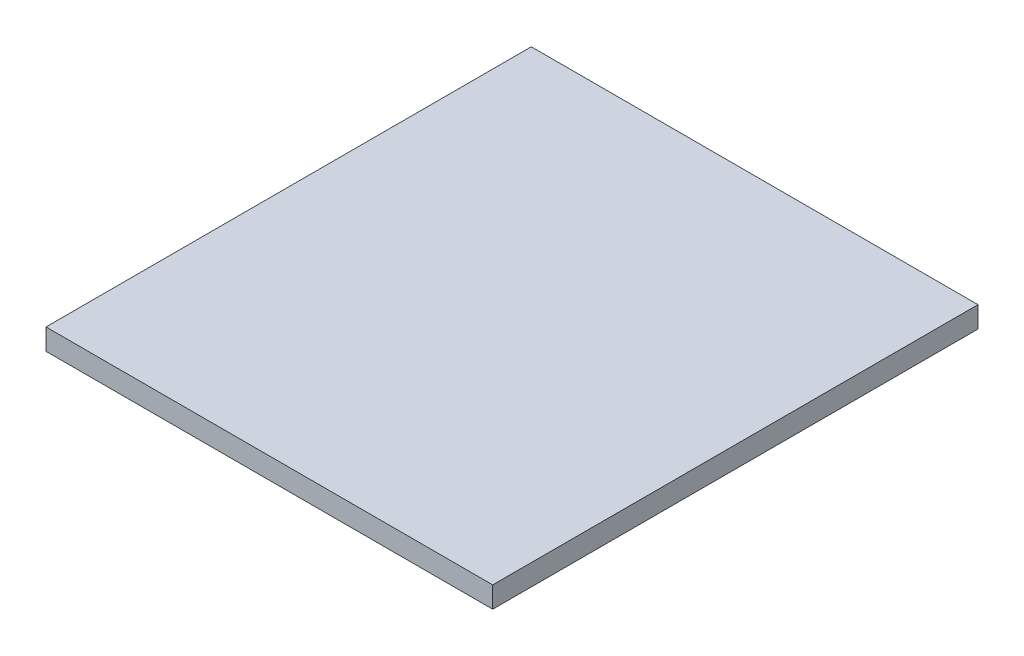
ISO-10303-21;
HEADER;
FILE_DESCRIPTION(('STEP AP214'),'2;1');
FILE_NAME('part.step','',(''),(''),'','','');
FILE_SCHEMA(('AUTOMOTIVE_DESIGN { 1 0 10303 214 1 1 1 1 }'));
ENDSEC;
DATA;
#1=APPLICATION_CONTEXT('core data for automotive mechanical design processes');
#2=APPLICATION_PROTOCOL_DEFINITION('international standard','automotive_design',2000,#1);
#3=PRODUCT_CONTEXT('',#1,'mechanical');
#4=PRODUCT('Part','Part','',(#3));
#5=PRODUCT_RELATED_PRODUCT_CATEGORY('part','',(#4));
#6=PRODUCT_DEFINITION_FORMATION('','',#4);
#7=PRODUCT_DEFINITION_CONTEXT('part definition',#1,'design');
#8=PRODUCT_DEFINITION('design','',#6,#7);
#9=PRODUCT_DEFINITION_SHAPE('','',#8);
#10=(LENGTH_UNIT() NAMED_UNIT(*) SI_UNIT(.MILLI.,.METRE.));
#11=(NAMED_UNIT(*) PLANE_ANGLE_UNIT() SI_UNIT($,.RADIAN.));
#12=(NAMED_UNIT(*) SI_UNIT($,.STERADIAN.) SOLID_ANGLE_UNIT());
#13=UNCERTAINTY_MEASURE_WITH_UNIT(LENGTH_MEASURE(1.E-05),#10,'distance_accuracy_value','');
#14=(GEOMETRIC_REPRESENTATION_CONTEXT(3) GLOBAL_UNCERTAINTY_ASSIGNED_CONTEXT((#13)) GLOBAL_UNIT_ASSIGNED_CONTEXT((#10,
#11,#12)) REPRESENTATION_CONTEXT('',''));
#15=CARTESIAN_POINT('',(0.,0.,0.));
#16=DIRECTION('',(0.,0.,1.));
#17=DIRECTION('',(1.,0.,0.));
#18=AXIS2_PLACEMENT_3D('',#15,#16,#17);
#19=CARTESIAN_POINT('',(6.,4.16,0.));
#20=DIRECTION('',(1.,0.,0.));
#21=DIRECTION('',(0.,0.,-1.));
#22=AXIS2_PLACEMENT_3D('',#19,#20,#21);
#23=PLANE('',#22);
#24=DIRECTION('',(0.,0.,1.));
#25=VECTOR('',#24,1.);
#26=CARTESIAN_POINT('',(6.,0.,0.));
#27=LINE('',#26,#25);
#28=CARTESIAN_POINT('',(6.,0.,-95.6));
#29=VERTEX_POINT('',#28);
#30=CARTESIAN_POINT('',(6.,0.,0.));
#31=VERTEX_POINT('',#30);
#32=EDGE_CURVE('E96',#29,#31,#27,.T.);
#33=ORIENTED_EDGE('',*,*,#32,.T.);
#34=DIRECTION('',(0.,-1.,0.));
#35=VECTOR('',#34,1.);
#36=CARTESIAN_POINT('',(6.,4.16,0.));
#37=LINE('',#36,#35);
#38=CARTESIAN_POINT('',(6.,4.16,0.));
#39=VERTEX_POINT('',#38);
#40=EDGE_CURVE('E11',#39,#31,#37,.T.);
#41=ORIENTED_EDGE('',*,*,#40,.F.);
#42=DIRECTION('',(0.,0.,1.));
#43=VECTOR('',#42,1.);
#44=CARTESIAN_POINT('',(6.,4.16,0.));
#45=LINE('',#44,#43);
#46=CARTESIAN_POINT('',(6.,4.16,-95.6));
#47=VERTEX_POINT('',#46);
#48=EDGE_CURVE('E84',#47,#39,#45,.T.);
#49=ORIENTED_EDGE('',*,*,#48,.F.);
#50=DIRECTION('',(0.,-1.,0.));
#51=VECTOR('',#50,1.);
#52=CARTESIAN_POINT('',(6.,4.16,-95.6));
#53=LINE('',#52,#51);
#54=EDGE_CURVE('E92',#47,#29,#53,.T.);
#55=ORIENTED_EDGE('',*,*,#54,.T.);
#56=EDGE_LOOP('',(#33,#41,#49,#55));
#57=FACE_BOUND('',#56,.T.);
#58=ADVANCED_FACE('F33',(#57),#23,.F.);
#59=CARTESIAN_POINT('',(6.,4.16,0.));
#60=DIRECTION('',(0.,0.,-1.));
#61=DIRECTION('',(-1.,0.,0.));
#62=AXIS2_PLACEMENT_3D('',#59,#60,#61);
#63=PLANE('',#62);
#64=DIRECTION('',(1.,0.,0.));
#65=VECTOR('',#64,1.);
#66=CARTESIAN_POINT('',(6.,0.,0.));
#67=LINE('',#66,#65);
#68=CARTESIAN_POINT('',(94.,0.,0.));
#69=VERTEX_POINT('',#68);
#70=EDGE_CURVE('E88',#31,#69,#67,.T.);
#71=ORIENTED_EDGE('',*,*,#70,.T.);
#72=DIRECTION('',(0.,-1.,0.));
#73=VECTOR('',#72,1.);
#74=CARTESIAN_POINT('',(94.,4.16,0.));
#75=LINE('',#74,#73);
#76=CARTESIAN_POINT('',(94.,4.16,0.));
#77=VERTEX_POINT('',#76);
#78=EDGE_CURVE('E41',#77,#69,#75,.T.);
#79=ORIENTED_EDGE('',*,*,#78,.F.);
#80=DIRECTION('',(1.,0.,0.));
#81=VECTOR('',#80,1.);
#82=CARTESIAN_POINT('',(6.,4.16,0.));
#83=LINE('',#82,#81);
#84=EDGE_CURVE('E79',#39,#77,#83,.T.);
#85=ORIENTED_EDGE('',*,*,#84,.F.);
#86=ORIENTED_EDGE('',*,*,#40,.T.);
#87=EDGE_LOOP('',(#71,#79,#85,#86));
#88=FACE_BOUND('',#87,.T.);
#89=ADVANCED_FACE('F87',(#88),#63,.F.);
#90=CARTESIAN_POINT('',(94.,4.16,0.));
#91=DIRECTION('',(-1.,0.,0.));
#92=DIRECTION('',(0.,0.,1.));
#93=AXIS2_PLACEMENT_3D('',#90,#91,#92);
#94=PLANE('',#93);
#95=DIRECTION('',(0.,0.,-1.));
#96=VECTOR('',#95,1.);
#97=CARTESIAN_POINT('',(94.,0.,0.));
#98=LINE('',#97,#96);
#99=CARTESIAN_POINT('',(94.,0.,-95.6));
#100=VERTEX_POINT('',#99);
#101=EDGE_CURVE('E66',#69,#100,#98,.T.);
#102=ORIENTED_EDGE('',*,*,#101,.T.);
#103=DIRECTION('',(0.,-1.,0.));
#104=VECTOR('',#103,1.);
#105=CARTESIAN_POINT('',(94.,4.16,-95.6));
#106=LINE('',#105,#104);
#107=CARTESIAN_POINT('',(94.,4.16,-95.6));
#108=VERTEX_POINT('',#107);
#109=EDGE_CURVE('E89',#108,#100,#106,.T.);
#110=ORIENTED_EDGE('',*,*,#109,.F.);
#111=DIRECTION('',(0.,0.,-1.));
#112=VECTOR('',#111,1.);
#113=CARTESIAN_POINT('',(94.,4.16,0.));
#114=LINE('',#113,#112);
#115=EDGE_CURVE('E82',#77,#108,#114,.T.);
#116=ORIENTED_EDGE('',*,*,#115,.F.);
#117=ORIENTED_EDGE('',*,*,#78,.T.);
#118=EDGE_LOOP('',(#102,#110,#116,#117));
#119=FACE_BOUND('',#118,.T.);
#120=ADVANCED_FACE('F90',(#119),#94,.F.);
#121=CARTESIAN_POINT('',(6.,4.16,-95.6));
#122=DIRECTION('',(0.,0.,1.));
#123=DIRECTION('',(1.,0.,0.));
#124=AXIS2_PLACEMENT_3D('',#121,#122,#123);
#125=PLANE('',#124);
#126=DIRECTION('',(-1.,0.,0.));
#127=VECTOR('',#126,1.);
#128=CARTESIAN_POINT('',(6.,0.,-95.6));
#129=LINE('',#128,#127);
#130=EDGE_CURVE('E72',#100,#29,#129,.T.);
#131=ORIENTED_EDGE('',*,*,#130,.T.);
#132=ORIENTED_EDGE('',*,*,#54,.F.);
#133=DIRECTION('',(-1.,0.,0.));
#134=VECTOR('',#133,1.);
#135=CARTESIAN_POINT('',(6.,4.16,-95.6));
#136=LINE('',#135,#134);
#137=EDGE_CURVE('E49',#108,#47,#136,.T.);
#138=ORIENTED_EDGE('',*,*,#137,.F.);
#139=ORIENTED_EDGE('',*,*,#109,.T.);
#140=EDGE_LOOP('',(#131,#132,#138,#139));
#141=FACE_BOUND('',#140,.T.);
#142=ADVANCED_FACE('F103',(#141),#125,.F.);
#143=CARTESIAN_POINT('',(0.,4.16,0.));
#144=DIRECTION('',(0.,-1.,0.));
#145=DIRECTION('',(0.,0.,-1.));
#146=AXIS2_PLACEMENT_3D('',#143,#144,#145);
#147=PLANE('',#146);
#148=ORIENTED_EDGE('',*,*,#48,.T.);
#149=ORIENTED_EDGE('',*,*,#84,.T.);
#150=ORIENTED_EDGE('',*,*,#115,.T.);
#151=ORIENTED_EDGE('',*,*,#137,.T.);
#152=EDGE_LOOP('',(#148,#149,#150,#151));
#153=FACE_BOUND('',#152,.T.);
#154=ADVANCED_FACE('F80',(#153),#147,.F.);
#155=CARTESIAN_POINT('',(0.,0.,0.));
#156=DIRECTION('',(0.,-1.,0.));
#157=DIRECTION('',(0.,0.,-1.));
#158=AXIS2_PLACEMENT_3D('',#155,#156,#157);
#159=PLANE('',#158);
#160=ORIENTED_EDGE('',*,*,#32,.F.);
#161=ORIENTED_EDGE('',*,*,#130,.F.);
#162=ORIENTED_EDGE('',*,*,#101,.F.);
#163=ORIENTED_EDGE('',*,*,#70,.F.);
#164=EDGE_LOOP('',(#160,#161,#162,#163));
#165=FACE_BOUND('',#164,.T.);
#166=ADVANCED_FACE('F106',(#165),#159,.T.);
#167=CLOSED_SHELL('',(#58,#89,#120,#142,#154,#166));
#168=MANIFOLD_SOLID_BREP('B2',#167);
#169=ADVANCED_BREP_SHAPE_REPRESENTATION('',(#18,#168),#14);
#170=SHAPE_DEFINITION_REPRESENTATION(#9,#169);
ENDSEC;
END-ISO-10303-21;
